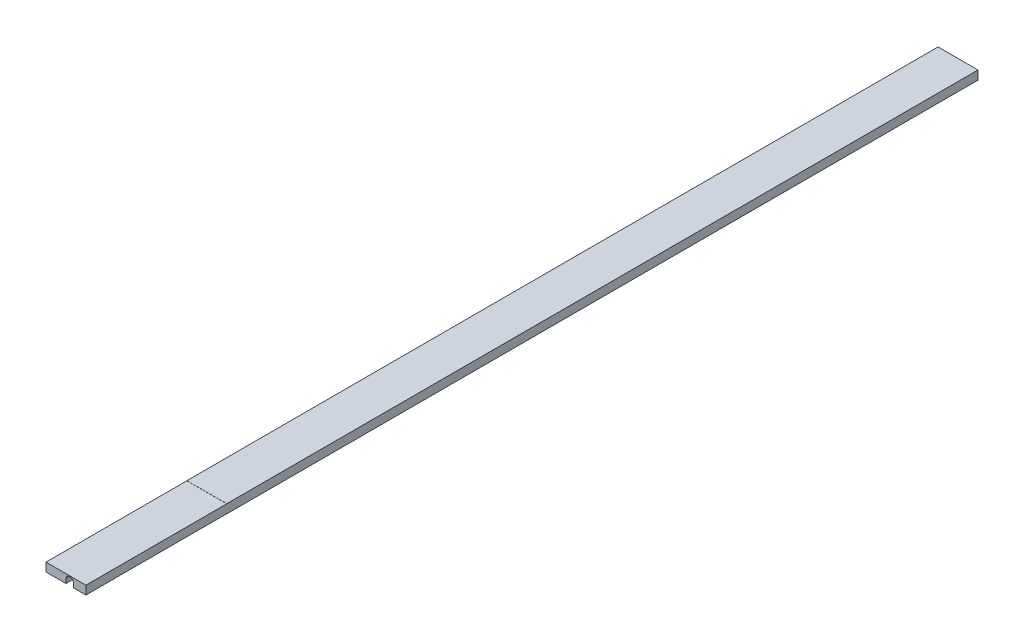
ISO-10303-21;
HEADER;
FILE_DESCRIPTION(('STEP AP214'),'2;1');
FILE_NAME('part.step','',(''),(''),'','','');
FILE_SCHEMA(('AUTOMOTIVE_DESIGN { 1 0 10303 214 1 1 1 1 }'));
ENDSEC;
DATA;
#1=APPLICATION_CONTEXT('core data for automotive mechanical design processes');
#2=APPLICATION_PROTOCOL_DEFINITION('international standard','automotive_design',2000,#1);
#3=PRODUCT_CONTEXT('',#1,'mechanical');
#4=PRODUCT('Part','Part','',(#3));
#5=PRODUCT_RELATED_PRODUCT_CATEGORY('part','',(#4));
#6=PRODUCT_DEFINITION_FORMATION('','',#4);
#7=PRODUCT_DEFINITION_CONTEXT('part definition',#1,'design');
#8=PRODUCT_DEFINITION('design','',#6,#7);
#9=PRODUCT_DEFINITION_SHAPE('','',#8);
#10=(LENGTH_UNIT() NAMED_UNIT(*) SI_UNIT(.MILLI.,.METRE.));
#11=(NAMED_UNIT(*) PLANE_ANGLE_UNIT() SI_UNIT($,.RADIAN.));
#12=(NAMED_UNIT(*) SI_UNIT($,.STERADIAN.) SOLID_ANGLE_UNIT());
#13=UNCERTAINTY_MEASURE_WITH_UNIT(LENGTH_MEASURE(1.E-05),#10,'distance_accuracy_value','');
#14=(GEOMETRIC_REPRESENTATION_CONTEXT(3) GLOBAL_UNCERTAINTY_ASSIGNED_CONTEXT((#13)) GLOBAL_UNIT_ASSIGNED_CONTEXT((#10,
#11,#12)) REPRESENTATION_CONTEXT('',''));
#15=CARTESIAN_POINT('',(0.,0.,0.));
#16=DIRECTION('',(0.,0.,1.));
#17=DIRECTION('',(1.,0.,0.));
#18=AXIS2_PLACEMENT_3D('',#15,#16,#17);
#19=CARTESIAN_POINT('',(-12.5,-2.75,259.4));
#20=DIRECTION('',(0.,1.,0.));
#21=DIRECTION('',(0.,0.,1.));
#22=AXIS2_PLACEMENT_3D('',#19,#20,#21);
#23=PLANE('',#22);
#24=DIRECTION('',(0.,0.,-1.));
#25=VECTOR('',#24,1.);
#26=CARTESIAN_POINT('',(12.5,-2.75,259.4));
#27=LINE('',#26,#25);
#28=CARTESIAN_POINT('',(12.5,-2.75000000000001,191.15));
#29=VERTEX_POINT('',#28);
#30=CARTESIAN_POINT('',(12.5,-2.75,-279.4));
#31=VERTEX_POINT('',#30);
#32=EDGE_CURVE('E175',#29,#31,#27,.T.);
#33=ORIENTED_EDGE('',*,*,#32,.F.);
#34=DIRECTION('',(-1.,0.,0.));
#35=VECTOR('',#34,1.);
#36=CARTESIAN_POINT('',(12.5,-2.75000000000001,191.15));
#37=LINE('',#36,#35);
#38=CARTESIAN_POINT('',(4.76224999999999,-2.75000000000001,191.15));
#39=VERTEX_POINT('',#38);
#40=EDGE_CURVE('E208',#29,#39,#37,.T.);
#41=ORIENTED_EDGE('',*,*,#40,.T.);
#42=DIRECTION('',(0.,0.,1.));
#43=VECTOR('',#42,1.);
#44=CARTESIAN_POINT('',(4.76224999999999,-2.75,-279.4));
#45=LINE('',#44,#43);
#46=CARTESIAN_POINT('',(4.76224999999999,-2.75,-279.4));
#47=VERTEX_POINT('',#46);
#48=EDGE_CURVE('E241',#47,#39,#45,.T.);
#49=ORIENTED_EDGE('',*,*,#48,.F.);
#50=DIRECTION('',(1.,0.,0.));
#51=VECTOR('',#50,1.);
#52=CARTESIAN_POINT('',(-12.5,-2.75,-279.4));
#53=LINE('',#52,#51);
#54=EDGE_CURVE('E176',#47,#31,#53,.T.);
#55=ORIENTED_EDGE('',*,*,#54,.T.);
#56=EDGE_LOOP('',(#33,#41,#49,#55));
#57=FACE_BOUND('',#56,.T.);
#58=ADVANCED_FACE('F37',(#57),#23,.F.);
#59=CARTESIAN_POINT('',(12.5,2.75,259.4));
#60=DIRECTION('',(-1.,0.,0.));
#61=DIRECTION('',(0.,-1.,0.));
#62=AXIS2_PLACEMENT_3D('',#59,#60,#61);
#63=PLANE('',#62);
#64=DIRECTION('',(0.,0.,-1.));
#65=VECTOR('',#64,1.);
#66=CARTESIAN_POINT('',(12.5,-2.68142,279.4));
#67=LINE('',#66,#65);
#68=CARTESIAN_POINT('',(12.5,-2.68142,279.4));
#69=VERTEX_POINT('',#68);
#70=CARTESIAN_POINT('',(12.5,-2.68142000000001,191.15));
#71=VERTEX_POINT('',#70);
#72=EDGE_CURVE('E136',#69,#71,#67,.T.);
#73=ORIENTED_EDGE('',*,*,#72,.T.);
#74=DIRECTION('',(0.,-1.,0.));
#75=VECTOR('',#74,1.);
#76=CARTESIAN_POINT('',(12.5,-2.75000000000001,191.15));
#77=LINE('',#76,#75);
#78=EDGE_CURVE('E144',#71,#29,#77,.T.);
#79=ORIENTED_EDGE('',*,*,#78,.T.);
#80=ORIENTED_EDGE('',*,*,#32,.T.);
#81=DIRECTION('',(0.,1.,0.));
#82=VECTOR('',#81,1.);
#83=CARTESIAN_POINT('',(12.5,-34.7656211871642,-279.4));
#84=LINE('',#83,#82);
#85=CARTESIAN_POINT('',(12.5,2.75,-279.4));
#86=VERTEX_POINT('',#85);
#87=EDGE_CURVE('E165',#31,#86,#84,.T.);
#88=ORIENTED_EDGE('',*,*,#87,.T.);
#89=DIRECTION('',(0.,0.,-1.));
#90=VECTOR('',#89,1.);
#91=CARTESIAN_POINT('',(12.5,2.75,259.4));
#92=LINE('',#91,#90);
#93=CARTESIAN_POINT('',(12.5,2.74999999999999,191.15));
#94=VERTEX_POINT('',#93);
#95=EDGE_CURVE('E188',#94,#86,#92,.T.);
#96=ORIENTED_EDGE('',*,*,#95,.F.);
#97=DIRECTION('',(0.,-1.,0.));
#98=VECTOR('',#97,1.);
#99=CARTESIAN_POINT('',(12.5,2.74999999999999,191.15));
#100=LINE('',#99,#98);
#101=CARTESIAN_POINT('',(12.5,2.68141999999999,191.15));
#102=VERTEX_POINT('',#101);
#103=EDGE_CURVE('E212',#94,#102,#100,.T.);
#104=ORIENTED_EDGE('',*,*,#103,.T.);
#105=DIRECTION('',(0.,0.,1.));
#106=VECTOR('',#105,1.);
#107=CARTESIAN_POINT('',(12.5,2.68142,279.4));
#108=LINE('',#107,#106);
#109=CARTESIAN_POINT('',(12.5,2.68142,279.4));
#110=VERTEX_POINT('',#109);
#111=EDGE_CURVE('E160',#102,#110,#108,.T.);
#112=ORIENTED_EDGE('',*,*,#111,.T.);
#113=DIRECTION('',(0.,1.,0.));
#114=VECTOR('',#113,1.);
#115=CARTESIAN_POINT('',(12.5,-34.7656211871642,279.4));
#116=LINE('',#115,#114);
#117=EDGE_CURVE('E151',#69,#110,#116,.T.);
#118=ORIENTED_EDGE('',*,*,#117,.F.);
#119=EDGE_LOOP('',(#73,#79,#80,#88,#96,#104,#112,#118));
#120=FACE_BOUND('',#119,.T.);
#121=ADVANCED_FACE('F39',(#120),#63,.F.);
#122=CARTESIAN_POINT('',(-12.5,2.75,259.4));
#123=DIRECTION('',(0.,-1.,0.));
#124=DIRECTION('',(0.,0.,-1.));
#125=AXIS2_PLACEMENT_3D('',#122,#123,#124);
#126=PLANE('',#125);
#127=DIRECTION('',(0.,0.,-1.));
#128=VECTOR('',#127,1.);
#129=CARTESIAN_POINT('',(-12.5,2.75,259.4));
#130=LINE('',#129,#128);
#131=CARTESIAN_POINT('',(-12.5,2.74999999999999,191.15));
#132=VERTEX_POINT('',#131);
#133=CARTESIAN_POINT('',(-12.5,2.75,-279.4));
#134=VERTEX_POINT('',#133);
#135=EDGE_CURVE('E186',#132,#134,#130,.T.);
#136=ORIENTED_EDGE('',*,*,#135,.F.);
#137=DIRECTION('',(-1.,0.,0.));
#138=VECTOR('',#137,1.);
#139=CARTESIAN_POINT('',(12.5,2.74999999999999,191.15));
#140=LINE('',#139,#138);
#141=EDGE_CURVE('E216',#94,#132,#140,.T.);
#142=ORIENTED_EDGE('',*,*,#141,.F.);
#143=ORIENTED_EDGE('',*,*,#95,.T.);
#144=DIRECTION('',(-1.,0.,0.));
#145=VECTOR('',#144,1.);
#146=CARTESIAN_POINT('',(-12.5,2.75,-279.4));
#147=LINE('',#146,#145);
#148=EDGE_CURVE('E161',#86,#134,#147,.T.);
#149=ORIENTED_EDGE('',*,*,#148,.T.);
#150=EDGE_LOOP('',(#136,#142,#143,#149));
#151=FACE_BOUND('',#150,.T.);
#152=ADVANCED_FACE('F279',(#151),#126,.F.);
#153=CARTESIAN_POINT('',(-12.5,2.75,259.4));
#154=DIRECTION('',(1.,0.,0.));
#155=DIRECTION('',(0.,0.,-1.));
#156=AXIS2_PLACEMENT_3D('',#153,#154,#155);
#157=PLANE('',#156);
#158=DIRECTION('',(0.,0.,-1.));
#159=VECTOR('',#158,1.);
#160=CARTESIAN_POINT('',(-12.5,-2.75,259.4));
#161=LINE('',#160,#159);
#162=CARTESIAN_POINT('',(-12.5,-2.75000000000001,191.15));
#163=VERTEX_POINT('',#162);
#164=CARTESIAN_POINT('',(-12.5,-2.75,-279.4));
#165=VERTEX_POINT('',#164);
#166=EDGE_CURVE('E184',#163,#165,#161,.T.);
#167=ORIENTED_EDGE('',*,*,#166,.F.);
#168=DIRECTION('',(0.,-1.,0.));
#169=VECTOR('',#168,1.);
#170=CARTESIAN_POINT('',(-12.5,-2.75000000000001,191.15));
#171=LINE('',#170,#169);
#172=CARTESIAN_POINT('',(-12.5,-2.68142000000001,191.15));
#173=VERTEX_POINT('',#172);
#174=EDGE_CURVE('E145',#173,#163,#171,.T.);
#175=ORIENTED_EDGE('',*,*,#174,.F.);
#176=DIRECTION('',(0.,0.,-1.));
#177=VECTOR('',#176,1.);
#178=CARTESIAN_POINT('',(-12.5,-2.68142,279.4));
#179=LINE('',#178,#177);
#180=CARTESIAN_POINT('',(-12.5,-2.68142,279.4));
#181=VERTEX_POINT('',#180);
#182=EDGE_CURVE('E260',#181,#173,#179,.T.);
#183=ORIENTED_EDGE('',*,*,#182,.F.);
#184=DIRECTION('',(0.,1.,0.));
#185=VECTOR('',#184,1.);
#186=CARTESIAN_POINT('',(-12.5,-34.7656211871642,279.4));
#187=LINE('',#186,#185);
#188=CARTESIAN_POINT('',(-12.5,2.68141999999999,279.4));
#189=VERTEX_POINT('',#188);
#190=EDGE_CURVE('E162',#181,#189,#187,.T.);
#191=ORIENTED_EDGE('',*,*,#190,.T.);
#192=DIRECTION('',(0.,0.,1.));
#193=VECTOR('',#192,1.);
#194=CARTESIAN_POINT('',(-12.5,2.68142,279.4));
#195=LINE('',#194,#193);
#196=CARTESIAN_POINT('',(-12.5,2.68141999999999,191.15));
#197=VERTEX_POINT('',#196);
#198=EDGE_CURVE('E214',#197,#189,#195,.T.);
#199=ORIENTED_EDGE('',*,*,#198,.F.);
#200=DIRECTION('',(0.,-1.,0.));
#201=VECTOR('',#200,1.);
#202=CARTESIAN_POINT('',(-12.5,2.74999999999999,191.15));
#203=LINE('',#202,#201);
#204=EDGE_CURVE('E211',#132,#197,#203,.T.);
#205=ORIENTED_EDGE('',*,*,#204,.F.);
#206=ORIENTED_EDGE('',*,*,#135,.T.);
#207=DIRECTION('',(0.,1.,0.));
#208=VECTOR('',#207,1.);
#209=CARTESIAN_POINT('',(-12.5,-34.7656211871642,-279.4));
#210=LINE('',#209,#208);
#211=EDGE_CURVE('E178',#165,#134,#210,.T.);
#212=ORIENTED_EDGE('',*,*,#211,.F.);
#213=EDGE_LOOP('',(#167,#175,#183,#191,#199,#205,#206,#212));
#214=FACE_BOUND('',#213,.T.);
#215=ADVANCED_FACE('F264',(#214),#157,.F.);
#216=DIRECTION('',(0.,0.,1.));
#217=VECTOR('',#216,1.);
#218=CARTESIAN_POINT('',(-0.000250000000013694,-2.75,-279.4));
#219=LINE('',#218,#217);
#220=CARTESIAN_POINT('',(-0.000250000000013694,-2.75,-279.4));
#221=VERTEX_POINT('',#220);
#222=CARTESIAN_POINT('',(-0.000250000000014128,-2.75000000000001,191.15));
#223=VERTEX_POINT('',#222);
#224=EDGE_CURVE('E243',#221,#223,#219,.T.);
#225=ORIENTED_EDGE('',*,*,#224,.T.);
#226=EDGE_CURVE('E256',#223,#163,#37,.T.);
#227=ORIENTED_EDGE('',*,*,#226,.T.);
#228=ORIENTED_EDGE('',*,*,#166,.T.);
#229=EDGE_CURVE('E173',#165,#221,#53,.T.);
#230=ORIENTED_EDGE('',*,*,#229,.T.);
#231=EDGE_LOOP('',(#225,#227,#228,#230));
#232=FACE_BOUND('',#231,.T.);
#233=ADVANCED_FACE('F298',(#232),#23,.F.);
#234=CARTESIAN_POINT('',(-12.5,-34.7656211871642,-279.4));
#235=DIRECTION('',(0.,0.,-1.));
#236=DIRECTION('',(-1.,0.,0.));
#237=AXIS2_PLACEMENT_3D('',#234,#235,#236);
#238=PLANE('',#237);
#239=DIRECTION('',(0.,1.,0.));
#240=VECTOR('',#239,1.);
#241=CARTESIAN_POINT('',(4.76224999999999,-2.75,-279.4));
#242=LINE('',#241,#240);
#243=CARTESIAN_POINT('',(4.76224999999998,-0.1278,-279.4));
#244=VERTEX_POINT('',#243);
#245=EDGE_CURVE('E233',#47,#244,#242,.T.);
#246=ORIENTED_EDGE('',*,*,#245,.T.);
#247=CARTESIAN_POINT('',(2.38099999999999,-0.1278,-279.4));
#248=DIRECTION('',(0.,0.,1.));
#249=DIRECTION('',(1.,0.,0.));
#250=AXIS2_PLACEMENT_3D('',#247,#248,#249);
#251=CIRCLE('',#250,2.38125);
#252=CARTESIAN_POINT('',(-0.000250000000014561,-0.1278,-279.4));
#253=VERTEX_POINT('',#252);
#254=EDGE_CURVE('E227',#244,#253,#251,.T.);
#255=ORIENTED_EDGE('',*,*,#254,.T.);
#256=DIRECTION('',(0.,-1.,0.));
#257=VECTOR('',#256,1.);
#258=CARTESIAN_POINT('',(-0.000250000000014561,-0.1278,-279.4));
#259=LINE('',#258,#257);
#260=EDGE_CURVE('E230',#253,#221,#259,.T.);
#261=ORIENTED_EDGE('',*,*,#260,.T.);
#262=ORIENTED_EDGE('',*,*,#229,.F.);
#263=ORIENTED_EDGE('',*,*,#211,.T.);
#264=ORIENTED_EDGE('',*,*,#148,.F.);
#265=ORIENTED_EDGE('',*,*,#87,.F.);
#266=ORIENTED_EDGE('',*,*,#54,.F.);
#267=EDGE_LOOP('',(#246,#255,#261,#262,#263,#264,#265,#266));
#268=FACE_BOUND('',#267,.T.);
#269=ADVANCED_FACE('F275',(#268),#238,.T.);
#270=CARTESIAN_POINT('',(-12.5,-34.7656211871642,279.4));
#271=DIRECTION('',(0.,0.,1.));
#272=DIRECTION('',(1.,0.,0.));
#273=AXIS2_PLACEMENT_3D('',#270,#271,#272);
#274=PLANE('',#273);
#275=DIRECTION('',(-1.,0.,0.));
#276=VECTOR('',#275,1.);
#277=CARTESIAN_POINT('',(12.5,-2.68142,279.4));
#278=LINE('',#277,#276);
#279=CARTESIAN_POINT('',(4.76224999999999,-2.68142,279.4));
#280=VERTEX_POINT('',#279);
#281=EDGE_CURVE('E52',#69,#280,#278,.T.);
#282=ORIENTED_EDGE('',*,*,#281,.F.);
#283=ORIENTED_EDGE('',*,*,#117,.T.);
#284=DIRECTION('',(-1.,0.,0.));
#285=VECTOR('',#284,1.);
#286=CARTESIAN_POINT('',(12.5,2.68142,279.4));
#287=LINE('',#286,#285);
#288=EDGE_CURVE('E221',#110,#189,#287,.T.);
#289=ORIENTED_EDGE('',*,*,#288,.T.);
#290=ORIENTED_EDGE('',*,*,#190,.F.);
#291=CARTESIAN_POINT('',(-0.000250000000014128,-2.68142,279.4));
#292=VERTEX_POINT('',#291);
#293=EDGE_CURVE('E155',#292,#181,#278,.T.);
#294=ORIENTED_EDGE('',*,*,#293,.F.);
#295=DIRECTION('',(0.,-1.,0.));
#296=VECTOR('',#295,1.);
#297=CARTESIAN_POINT('',(-0.000250000000014561,-0.1278,279.4));
#298=LINE('',#297,#296);
#299=CARTESIAN_POINT('',(-0.000250000000013442,-0.127800000000004,279.4));
#300=VERTEX_POINT('',#299);
#301=EDGE_CURVE('E196',#300,#292,#298,.T.);
#302=ORIENTED_EDGE('',*,*,#301,.F.);
#303=CARTESIAN_POINT('',(2.38099999999999,-0.1278,279.4));
#304=DIRECTION('',(0.,0.,1.));
#305=DIRECTION('',(1.,0.,0.));
#306=AXIS2_PLACEMENT_3D('',#303,#304,#305);
#307=CIRCLE('',#306,2.38125);
#308=CARTESIAN_POINT('',(4.76224999999998,-0.1278,279.4));
#309=VERTEX_POINT('',#308);
#310=EDGE_CURVE('E223',#309,#300,#307,.T.);
#311=ORIENTED_EDGE('',*,*,#310,.F.);
#312=DIRECTION('',(0.,1.,0.));
#313=VECTOR('',#312,1.);
#314=CARTESIAN_POINT('',(4.76224999999999,-2.75,279.4));
#315=LINE('',#314,#313);
#316=EDGE_CURVE('E154',#280,#309,#315,.T.);
#317=ORIENTED_EDGE('',*,*,#316,.F.);
#318=EDGE_LOOP('',(#282,#283,#289,#290,#294,#302,#311,#317));
#319=FACE_BOUND('',#318,.T.);
#320=ADVANCED_FACE('F149',(#319),#274,.T.);
#321=CARTESIAN_POINT('',(2.38099999999999,-0.1278,-279.4));
#322=DIRECTION('',(0.,0.,1.));
#323=DIRECTION('',(1.,0.,0.));
#324=AXIS2_PLACEMENT_3D('',#321,#322,#323);
#325=CYLINDRICAL_SURFACE('',#324,2.38125);
#326=ORIENTED_EDGE('',*,*,#310,.T.);
#327=DIRECTION('',(0.,0.,1.));
#328=VECTOR('',#327,1.);
#329=CARTESIAN_POINT('',(-0.000250000000014561,-0.1278,-279.4));
#330=LINE('',#329,#328);
#331=EDGE_CURVE('E170',#253,#300,#330,.T.);
#332=ORIENTED_EDGE('',*,*,#331,.F.);
#333=ORIENTED_EDGE('',*,*,#254,.F.);
#334=DIRECTION('',(0.,0.,1.));
#335=VECTOR('',#334,1.);
#336=CARTESIAN_POINT('',(4.76224999999998,-0.1278,-279.4));
#337=LINE('',#336,#335);
#338=EDGE_CURVE('E167',#244,#309,#337,.T.);
#339=ORIENTED_EDGE('',*,*,#338,.T.);
#340=EDGE_LOOP('',(#326,#332,#333,#339));
#341=FACE_BOUND('',#340,.T.);
#342=ADVANCED_FACE('F249',(#341),#325,.F.);
#343=CARTESIAN_POINT('',(4.76224999999999,-2.75,-279.4));
#344=DIRECTION('',(1.,0.,0.));
#345=DIRECTION('',(0.,1.,0.));
#346=AXIS2_PLACEMENT_3D('',#343,#344,#345);
#347=PLANE('',#346);
#348=ORIENTED_EDGE('',*,*,#48,.T.);
#349=DIRECTION('',(0.,1.,0.));
#350=VECTOR('',#349,1.);
#351=CARTESIAN_POINT('',(4.76224999999999,-2.75,191.15));
#352=LINE('',#351,#350);
#353=CARTESIAN_POINT('',(4.76224999999999,-2.68142000000001,191.15));
#354=VERTEX_POINT('',#353);
#355=EDGE_CURVE('E207',#39,#354,#352,.T.);
#356=ORIENTED_EDGE('',*,*,#355,.T.);
#357=DIRECTION('',(0.,0.,1.));
#358=VECTOR('',#357,1.);
#359=CARTESIAN_POINT('',(4.76224999999999,-2.68142000000007,-279.4));
#360=LINE('',#359,#358);
#361=EDGE_CURVE('E205',#354,#280,#360,.T.);
#362=ORIENTED_EDGE('',*,*,#361,.T.);
#363=ORIENTED_EDGE('',*,*,#316,.T.);
#364=ORIENTED_EDGE('',*,*,#338,.F.);
#365=ORIENTED_EDGE('',*,*,#245,.F.);
#366=EDGE_LOOP('',(#348,#356,#362,#363,#364,#365));
#367=FACE_BOUND('',#366,.T.);
#368=ADVANCED_FACE('F251',(#367),#347,.F.);
#369=CARTESIAN_POINT('',(-0.000250000000014561,-0.1278,-279.4));
#370=DIRECTION('',(-1.,0.,0.));
#371=DIRECTION('',(0.,-1.,0.));
#372=AXIS2_PLACEMENT_3D('',#369,#370,#371);
#373=PLANE('',#372);
#374=DIRECTION('',(0.,0.,-1.));
#375=VECTOR('',#374,1.);
#376=CARTESIAN_POINT('',(-0.000250000000013717,-2.68142000000007,-279.4));
#377=LINE('',#376,#375);
#378=CARTESIAN_POINT('',(-0.000250000000013717,-2.68142000000001,191.15));
#379=VERTEX_POINT('',#378);
#380=EDGE_CURVE('E45',#292,#379,#377,.T.);
#381=ORIENTED_EDGE('',*,*,#380,.T.);
#382=DIRECTION('',(0.,-1.,0.));
#383=VECTOR('',#382,1.);
#384=CARTESIAN_POINT('',(-0.000250000000014561,-0.1278,191.15));
#385=LINE('',#384,#383);
#386=EDGE_CURVE('E11',#379,#223,#385,.T.);
#387=ORIENTED_EDGE('',*,*,#386,.T.);
#388=ORIENTED_EDGE('',*,*,#224,.F.);
#389=ORIENTED_EDGE('',*,*,#260,.F.);
#390=ORIENTED_EDGE('',*,*,#331,.T.);
#391=ORIENTED_EDGE('',*,*,#301,.T.);
#392=EDGE_LOOP('',(#381,#387,#388,#389,#390,#391));
#393=FACE_BOUND('',#392,.T.);
#394=ADVANCED_FACE('F192',(#393),#373,.F.);
#395=CARTESIAN_POINT('',(12.5,2.68142,279.4));
#396=DIRECTION('',(0.,-1.,0.));
#397=DIRECTION('',(0.,0.,-1.));
#398=AXIS2_PLACEMENT_3D('',#395,#396,#397);
#399=PLANE('',#398);
#400=ORIENTED_EDGE('',*,*,#198,.T.);
#401=ORIENTED_EDGE('',*,*,#288,.F.);
#402=ORIENTED_EDGE('',*,*,#111,.F.);
#403=DIRECTION('',(-1.,0.,0.));
#404=VECTOR('',#403,1.);
#405=CARTESIAN_POINT('',(12.5,2.68141999999999,191.15));
#406=LINE('',#405,#404);
#407=EDGE_CURVE('E224',#102,#197,#406,.T.);
#408=ORIENTED_EDGE('',*,*,#407,.T.);
#409=EDGE_LOOP('',(#400,#401,#402,#408));
#410=FACE_BOUND('',#409,.T.);
#411=ADVANCED_FACE('F286',(#410),#399,.F.);
#412=CARTESIAN_POINT('',(12.5,2.74999999999999,191.15));
#413=DIRECTION('',(0.,0.,-1.));
#414=DIRECTION('',(-1.,0.,0.));
#415=AXIS2_PLACEMENT_3D('',#412,#413,#414);
#416=PLANE('',#415);
#417=ORIENTED_EDGE('',*,*,#204,.T.);
#418=ORIENTED_EDGE('',*,*,#407,.F.);
#419=ORIENTED_EDGE('',*,*,#103,.F.);
#420=ORIENTED_EDGE('',*,*,#141,.T.);
#421=EDGE_LOOP('',(#417,#418,#419,#420));
#422=FACE_BOUND('',#421,.T.);
#423=ADVANCED_FACE('F282',(#422),#416,.F.);
#424=CARTESIAN_POINT('',(12.5,-2.68142,279.4));
#425=DIRECTION('',(0.,1.,0.));
#426=DIRECTION('',(0.,0.,1.));
#427=AXIS2_PLACEMENT_3D('',#424,#425,#426);
#428=PLANE('',#427);
#429=ORIENTED_EDGE('',*,*,#293,.T.);
#430=ORIENTED_EDGE('',*,*,#182,.T.);
#431=DIRECTION('',(-1.,0.,0.));
#432=VECTOR('',#431,1.);
#433=CARTESIAN_POINT('',(12.5,-2.68142000000001,191.15));
#434=LINE('',#433,#432);
#435=EDGE_CURVE('E60',#379,#173,#434,.T.);
#436=ORIENTED_EDGE('',*,*,#435,.F.);
#437=ORIENTED_EDGE('',*,*,#380,.F.);
#438=EDGE_LOOP('',(#429,#430,#436,#437));
#439=FACE_BOUND('',#438,.T.);
#440=ADVANCED_FACE('F198',(#439),#428,.F.);
#441=CARTESIAN_POINT('',(12.5,-2.75000000000001,191.15));
#442=DIRECTION('',(0.,0.,-1.));
#443=DIRECTION('',(-1.,0.,0.));
#444=AXIS2_PLACEMENT_3D('',#441,#442,#443);
#445=PLANE('',#444);
#446=ORIENTED_EDGE('',*,*,#435,.T.);
#447=ORIENTED_EDGE('',*,*,#174,.T.);
#448=ORIENTED_EDGE('',*,*,#226,.F.);
#449=ORIENTED_EDGE('',*,*,#386,.F.);
#450=EDGE_LOOP('',(#446,#447,#448,#449));
#451=FACE_BOUND('',#450,.T.);
#452=ADVANCED_FACE('F258',(#451),#445,.F.);
#453=ORIENTED_EDGE('',*,*,#40,.F.);
#454=ORIENTED_EDGE('',*,*,#78,.F.);
#455=EDGE_CURVE('E139',#71,#354,#434,.T.);
#456=ORIENTED_EDGE('',*,*,#455,.T.);
#457=ORIENTED_EDGE('',*,*,#355,.F.);
#458=EDGE_LOOP('',(#453,#454,#456,#457));
#459=FACE_BOUND('',#458,.T.);
#460=ADVANCED_FACE('F254',(#459),#445,.F.);
#461=ORIENTED_EDGE('',*,*,#455,.F.);
#462=ORIENTED_EDGE('',*,*,#72,.F.);
#463=ORIENTED_EDGE('',*,*,#281,.T.);
#464=ORIENTED_EDGE('',*,*,#361,.F.);
#465=EDGE_LOOP('',(#461,#462,#463,#464));
#466=FACE_BOUND('',#465,.T.);
#467=ADVANCED_FACE('F137',(#466),#428,.F.);
#468=CLOSED_SHELL('',(#58,#121,#152,#215,#233,#269,#320,#342,#368,#394,#411,#423,#440,#452,#460,#467));
#469=MANIFOLD_SOLID_BREP('B2',#468);
#470=ADVANCED_BREP_SHAPE_REPRESENTATION('',(#18,#469),#14);
#471=SHAPE_DEFINITION_REPRESENTATION(#9,#470);
ENDSEC;
END-ISO-10303-21;
